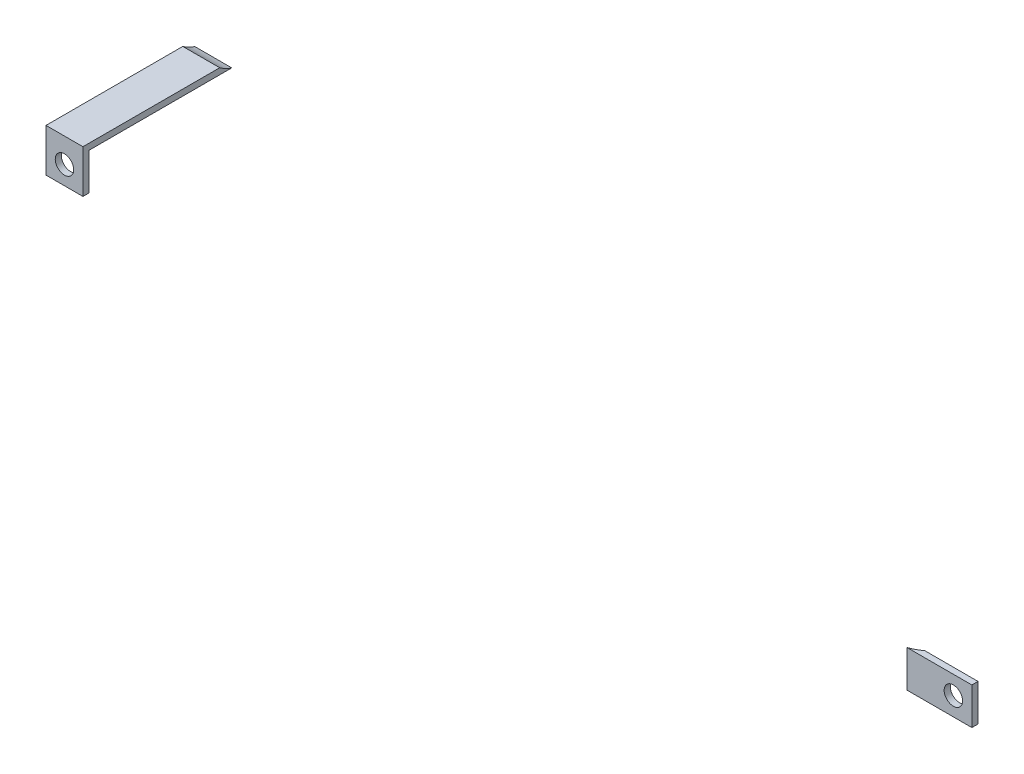
ISO-10303-21;
HEADER;
FILE_DESCRIPTION(('STEP AP214'),'2;1');
FILE_NAME('part.step','',(''),(''),'','','');
FILE_SCHEMA(('AUTOMOTIVE_DESIGN { 1 0 10303 214 1 1 1 1 }'));
ENDSEC;
DATA;
#1=APPLICATION_CONTEXT('core data for automotive mechanical design processes');
#2=APPLICATION_PROTOCOL_DEFINITION('international standard','automotive_design',2000,#1);
#3=PRODUCT_CONTEXT('',#1,'mechanical');
#4=PRODUCT('Part','Part','',(#3));
#5=PRODUCT_RELATED_PRODUCT_CATEGORY('part','',(#4));
#6=PRODUCT_DEFINITION_FORMATION('','',#4);
#7=PRODUCT_DEFINITION_CONTEXT('part definition',#1,'design');
#8=PRODUCT_DEFINITION('design','',#6,#7);
#9=PRODUCT_DEFINITION_SHAPE('','',#8);
#10=(LENGTH_UNIT() NAMED_UNIT(*) SI_UNIT(.MILLI.,.METRE.));
#11=(NAMED_UNIT(*) PLANE_ANGLE_UNIT() SI_UNIT($,.RADIAN.));
#12=(NAMED_UNIT(*) SI_UNIT($,.STERADIAN.) SOLID_ANGLE_UNIT());
#13=UNCERTAINTY_MEASURE_WITH_UNIT(LENGTH_MEASURE(1.E-05),#10,'distance_accuracy_value','');
#14=(GEOMETRIC_REPRESENTATION_CONTEXT(3) GLOBAL_UNCERTAINTY_ASSIGNED_CONTEXT((#13)) GLOBAL_UNIT_ASSIGNED_CONTEXT((#10,
#11,#12)) REPRESENTATION_CONTEXT('',''));
#15=CARTESIAN_POINT('',(0.,0.,0.));
#16=DIRECTION('',(0.,0.,1.));
#17=DIRECTION('',(1.,0.,0.));
#18=AXIS2_PLACEMENT_3D('',#15,#16,#17);
#19=CARTESIAN_POINT('',(-22.8519549129285,185.,100.));
#20=DIRECTION('',(-1.,0.,0.));
#21=DIRECTION('',(0.,0.,1.));
#22=AXIS2_PLACEMENT_3D('',#19,#20,#21);
#23=CYLINDRICAL_SURFACE('',#22,12.5);
#24=CARTESIAN_POINT('',(-34.8519549129285,185.,112.5));
#25=CARTESIAN_POINT('',(-34.8519549129285,160.,112.5));
#26=CARTESIAN_POINT('',(-34.8519549129285,160.,87.5));
#27=CARTESIAN_POINT('',(-34.8519549129285,185.,87.5));
#28=CARTESIAN_POINT('',(-34.8519549129285,210.,87.5));
#29=CARTESIAN_POINT('',(-34.8519549129285,210.,112.5));
#30=CARTESIAN_POINT('',(-34.8519549129285,185.,112.5));
#31=(BOUNDED_CURVE() B_SPLINE_CURVE(3,(#24,#25,#26,#27,#28,#29,#30),.UNSPECIFIED.,.T.,
.F.) B_SPLINE_CURVE_WITH_KNOTS((4,3,4),(0.,0.5,1.),
.UNSPECIFIED.) CURVE() GEOMETRIC_REPRESENTATION_ITEM() RATIONAL_B_SPLINE_CURVE((1.,
0.333333333333333,0.333333333333333,1.,0.333333333333333,0.333333333333333,1.)) REPRESENTATION_ITEM(''));
#32=CARTESIAN_POINT('',(-34.8519549129285,175.040321072079,107.553462494295));
#33=VERTEX_POINT('',#32);
#34=CARTESIAN_POINT('',(-34.8519549129285,173.040321072079,103.635392680446));
#35=VERTEX_POINT('',#34);
#36=EDGE_CURVE('E132',#33,#35,#31,.T.);
#37=ORIENTED_EDGE('',*,*,#36,.F.);
#38=DIRECTION('',(-1.,0.,0.));
#39=VECTOR('',#38,1.);
#40=CARTESIAN_POINT('',(-22.8519549129285,175.040321072079,107.553462494295));
#41=LINE('',#40,#39);
#42=CARTESIAN_POINT('',(-22.8519549129285,175.040321072079,107.553462494295));
#43=VERTEX_POINT('',#42);
#44=EDGE_CURVE('E12',#43,#33,#41,.T.);
#45=ORIENTED_EDGE('',*,*,#44,.F.);
#46=CARTESIAN_POINT('',(-22.8519549129285,185.,112.5));
#47=CARTESIAN_POINT('',(-22.8519549129285,160.,112.5));
#48=CARTESIAN_POINT('',(-22.8519549129285,160.,87.5));
#49=CARTESIAN_POINT('',(-22.8519549129285,185.,87.5));
#50=CARTESIAN_POINT('',(-22.8519549129285,210.,87.5));
#51=CARTESIAN_POINT('',(-22.8519549129285,210.,112.5));
#52=CARTESIAN_POINT('',(-22.8519549129285,185.,112.5));
#53=(BOUNDED_CURVE() B_SPLINE_CURVE(3,(#46,#47,#48,#49,#50,#51,#52),.UNSPECIFIED.,.T.,
.F.) B_SPLINE_CURVE_WITH_KNOTS((4,3,4),(0.,0.5,1.),
.UNSPECIFIED.) CURVE() GEOMETRIC_REPRESENTATION_ITEM() RATIONAL_B_SPLINE_CURVE((1.,
0.333333333333333,0.333333333333333,1.,0.333333333333333,0.333333333333333,1.)) REPRESENTATION_ITEM(''));
#54=CARTESIAN_POINT('',(-22.8519549129285,173.040321072079,103.635392680446));
#55=VERTEX_POINT('',#54);
#56=EDGE_CURVE('E152',#43,#55,#53,.T.);
#57=ORIENTED_EDGE('',*,*,#56,.T.);
#58=DIRECTION('',(-1.,0.,0.));
#59=VECTOR('',#58,1.);
#60=CARTESIAN_POINT('',(-22.8519549129285,173.040321072079,103.635392680446));
#61=LINE('',#60,#59);
#62=EDGE_CURVE('E50',#55,#35,#61,.T.);
#63=ORIENTED_EDGE('',*,*,#62,.T.);
#64=EDGE_LOOP('',(#37,#45,#57,#63));
#65=FACE_BOUND('',#64,.T.);
#66=ADVANCED_FACE('F47',(#65),#23,.F.);
#67=CARTESIAN_POINT('',(-22.8519549129285,175.040321072079,107.553462494295));
#68=DIRECTION('',(0.,1.,0.));
#69=DIRECTION('',(0.,0.,1.));
#70=AXIS2_PLACEMENT_3D('',#67,#68,#69);
#71=PLANE('',#70);
#72=DIRECTION('',(0.,0.,-1.));
#73=VECTOR('',#72,1.);
#74=CARTESIAN_POINT('',(-34.8519549129285,175.040321072079,107.553462494295));
#75=LINE('',#74,#73);
#76=CARTESIAN_POINT('',(-34.8519549129284,175.040321072076,152.));
#77=VERTEX_POINT('',#76);
#78=EDGE_CURVE('E150',#77,#33,#75,.T.);
#79=ORIENTED_EDGE('',*,*,#78,.F.);
#80=DIRECTION('',(-1.,0.,0.));
#81=VECTOR('',#80,1.);
#82=CARTESIAN_POINT('',(-22.8519549129284,175.040321072076,152.));
#83=LINE('',#82,#81);
#84=CARTESIAN_POINT('',(-22.8519549129284,175.040321072076,152.));
#85=VERTEX_POINT('',#84);
#86=EDGE_CURVE('E56',#85,#77,#83,.T.);
#87=ORIENTED_EDGE('',*,*,#86,.F.);
#88=DIRECTION('',(0.,0.,-1.));
#89=VECTOR('',#88,1.);
#90=CARTESIAN_POINT('',(-22.8519549129285,175.040321072079,107.553462494295));
#91=LINE('',#90,#89);
#92=EDGE_CURVE('E122',#85,#43,#91,.T.);
#93=ORIENTED_EDGE('',*,*,#92,.T.);
#94=ORIENTED_EDGE('',*,*,#44,.T.);
#95=EDGE_LOOP('',(#79,#87,#93,#94));
#96=FACE_BOUND('',#95,.T.);
#97=ADVANCED_FACE('F160',(#96),#71,.T.);
#98=CARTESIAN_POINT('',(-22.8519549129284,175.040321072076,152.));
#99=DIRECTION('',(0.,0.,1.));
#100=DIRECTION('',(1.,0.,0.));
#101=AXIS2_PLACEMENT_3D('',#98,#99,#100);
#102=PLANE('',#101);
#103=CARTESIAN_POINT('',(-28.8519549129285,167.040321072076,152.));
#104=DIRECTION('',(0.,0.,1.));
#105=DIRECTION('',(1.,0.,0.));
#106=AXIS2_PLACEMENT_3D('',#103,#104,#105);
#107=CIRCLE('',#106,2.99999999999999);
#108=CARTESIAN_POINT('',(-25.8519549129285,167.040321072076,152.));
#109=VERTEX_POINT('',#108);
#110=EDGE_CURVE('E138',#109,#109,#107,.T.);
#111=ORIENTED_EDGE('',*,*,#110,.F.);
#112=EDGE_LOOP('',(#111));
#113=FACE_BOUND('',#112,.T.);
#114=DIRECTION('',(0.,1.,0.));
#115=VECTOR('',#114,1.);
#116=CARTESIAN_POINT('',(-34.8519549129284,175.040321072076,152.));
#117=LINE('',#116,#115);
#118=CARTESIAN_POINT('',(-34.8519549129284,161.040321072076,152.));
#119=VERTEX_POINT('',#118);
#120=EDGE_CURVE('E109',#119,#77,#117,.T.);
#121=ORIENTED_EDGE('',*,*,#120,.F.);
#122=DIRECTION('',(-1.,0.,0.));
#123=VECTOR('',#122,1.);
#124=CARTESIAN_POINT('',(-22.8519549129284,161.040321072076,152.));
#125=LINE('',#124,#123);
#126=CARTESIAN_POINT('',(-22.8519549129284,161.040321072076,152.));
#127=VERTEX_POINT('',#126);
#128=EDGE_CURVE('E104',#127,#119,#125,.T.);
#129=ORIENTED_EDGE('',*,*,#128,.F.);
#130=DIRECTION('',(0.,1.,0.));
#131=VECTOR('',#130,1.);
#132=CARTESIAN_POINT('',(-22.8519549129284,175.040321072076,152.));
#133=LINE('',#132,#131);
#134=EDGE_CURVE('E107',#127,#85,#133,.T.);
#135=ORIENTED_EDGE('',*,*,#134,.T.);
#136=ORIENTED_EDGE('',*,*,#86,.T.);
#137=EDGE_LOOP('',(#121,#129,#135,#136));
#138=FACE_BOUND('',#137,.T.);
#139=ADVANCED_FACE('F106',(#113,#138),#102,.T.);
#140=CARTESIAN_POINT('',(-22.8519549129284,161.040321072076,152.));
#141=DIRECTION('',(0.,-1.,0.));
#142=DIRECTION('',(0.,0.,-1.));
#143=AXIS2_PLACEMENT_3D('',#140,#141,#142);
#144=PLANE('',#143);
#145=DIRECTION('',(0.,0.,1.));
#146=VECTOR('',#145,1.);
#147=CARTESIAN_POINT('',(-34.8519549129284,161.040321072076,152.));
#148=LINE('',#147,#146);
#149=CARTESIAN_POINT('',(-34.8519549129284,161.040321072076,150.));
#150=VERTEX_POINT('',#149);
#151=EDGE_CURVE('E147',#150,#119,#148,.T.);
#152=ORIENTED_EDGE('',*,*,#151,.F.);
#153=DIRECTION('',(-1.,0.,0.));
#154=VECTOR('',#153,1.);
#155=CARTESIAN_POINT('',(-22.8519549129284,161.040321072076,150.));
#156=LINE('',#155,#154);
#157=CARTESIAN_POINT('',(-22.8519549129284,161.040321072076,150.));
#158=VERTEX_POINT('',#157);
#159=EDGE_CURVE('E114',#158,#150,#156,.T.);
#160=ORIENTED_EDGE('',*,*,#159,.F.);
#161=DIRECTION('',(0.,0.,1.));
#162=VECTOR('',#161,1.);
#163=CARTESIAN_POINT('',(-22.8519549129284,161.040321072076,152.));
#164=LINE('',#163,#162);
#165=EDGE_CURVE('E120',#158,#127,#164,.T.);
#166=ORIENTED_EDGE('',*,*,#165,.T.);
#167=ORIENTED_EDGE('',*,*,#128,.T.);
#168=EDGE_LOOP('',(#152,#160,#166,#167));
#169=FACE_BOUND('',#168,.T.);
#170=ADVANCED_FACE('F124',(#169),#144,.T.);
#171=CARTESIAN_POINT('',(-22.8519549129284,161.040321072076,150.));
#172=DIRECTION('',(0.,0.,-1.));
#173=DIRECTION('',(0.,1.,0.));
#174=AXIS2_PLACEMENT_3D('',#171,#172,#173);
#175=PLANE('',#174);
#176=CARTESIAN_POINT('',(-28.8519549129285,167.040321072076,149.999999999999));
#177=DIRECTION('',(0.,0.,-1.));
#178=DIRECTION('',(0.,1.,0.));
#179=AXIS2_PLACEMENT_3D('',#176,#177,#178);
#180=CIRCLE('',#179,2.99999999999999);
#181=CARTESIAN_POINT('',(-28.8519549129285,170.040321072076,149.999999999999));
#182=VERTEX_POINT('',#181);
#183=EDGE_CURVE('E195',#182,#182,#180,.T.);
#184=ORIENTED_EDGE('',*,*,#183,.F.);
#185=EDGE_LOOP('',(#184));
#186=FACE_BOUND('',#185,.T.);
#187=DIRECTION('',(0.,-1.,0.));
#188=VECTOR('',#187,1.);
#189=CARTESIAN_POINT('',(-34.8519549129284,161.040321072076,150.));
#190=LINE('',#189,#188);
#191=CARTESIAN_POINT('',(-34.8519549129284,173.040321072076,150.));
#192=VERTEX_POINT('',#191);
#193=EDGE_CURVE('E144',#192,#150,#190,.T.);
#194=ORIENTED_EDGE('',*,*,#193,.F.);
#195=DIRECTION('',(-1.,0.,0.));
#196=VECTOR('',#195,1.);
#197=CARTESIAN_POINT('',(-22.8519549129284,173.040321072076,150.));
#198=LINE('',#197,#196);
#199=CARTESIAN_POINT('',(-22.8519549129284,173.040321072076,150.));
#200=VERTEX_POINT('',#199);
#201=EDGE_CURVE('E155',#200,#192,#198,.T.);
#202=ORIENTED_EDGE('',*,*,#201,.F.);
#203=DIRECTION('',(0.,-1.,0.));
#204=VECTOR('',#203,1.);
#205=CARTESIAN_POINT('',(-22.8519549129284,161.040321072076,150.));
#206=LINE('',#205,#204);
#207=EDGE_CURVE('E125',#200,#158,#206,.T.);
#208=ORIENTED_EDGE('',*,*,#207,.T.);
#209=ORIENTED_EDGE('',*,*,#159,.T.);
#210=EDGE_LOOP('',(#194,#202,#208,#209));
#211=FACE_BOUND('',#210,.T.);
#212=ADVANCED_FACE('F174',(#186,#211),#175,.T.);
#213=CARTESIAN_POINT('',(-22.8519549129284,173.040321072076,150.));
#214=DIRECTION('',(0.,-1.,0.));
#215=DIRECTION('',(0.,0.,-1.));
#216=AXIS2_PLACEMENT_3D('',#213,#214,#215);
#217=PLANE('',#216);
#218=DIRECTION('',(0.,0.,1.));
#219=VECTOR('',#218,1.);
#220=CARTESIAN_POINT('',(-34.8519549129284,173.040321072076,150.));
#221=LINE('',#220,#219);
#222=EDGE_CURVE('E137',#35,#192,#221,.T.);
#223=ORIENTED_EDGE('',*,*,#222,.F.);
#224=ORIENTED_EDGE('',*,*,#62,.F.);
#225=DIRECTION('',(0.,0.,1.));
#226=VECTOR('',#225,1.);
#227=CARTESIAN_POINT('',(-22.8519549129284,173.040321072076,150.));
#228=LINE('',#227,#226);
#229=EDGE_CURVE('E127',#55,#200,#228,.T.);
#230=ORIENTED_EDGE('',*,*,#229,.T.);
#231=ORIENTED_EDGE('',*,*,#201,.T.);
#232=EDGE_LOOP('',(#223,#224,#230,#231));
#233=FACE_BOUND('',#232,.T.);
#234=ADVANCED_FACE('F157',(#233),#217,.T.);
#235=CARTESIAN_POINT('',(-22.8519549129285,185.,87.5));
#236=DIRECTION('',(-1.,0.,0.));
#237=DIRECTION('',(0.,0.,1.));
#238=AXIS2_PLACEMENT_3D('',#235,#236,#237);
#239=PLANE('',#238);
#240=ORIENTED_EDGE('',*,*,#56,.F.);
#241=ORIENTED_EDGE('',*,*,#92,.F.);
#242=ORIENTED_EDGE('',*,*,#134,.F.);
#243=ORIENTED_EDGE('',*,*,#165,.F.);
#244=ORIENTED_EDGE('',*,*,#207,.F.);
#245=ORIENTED_EDGE('',*,*,#229,.F.);
#246=EDGE_LOOP('',(#240,#241,#242,#243,#244,#245));
#247=FACE_BOUND('',#246,.T.);
#248=ADVANCED_FACE('F118',(#247),#239,.F.);
#249=CARTESIAN_POINT('',(-34.8519549129285,185.,87.5));
#250=DIRECTION('',(-1.,0.,0.));
#251=DIRECTION('',(0.,0.,1.));
#252=AXIS2_PLACEMENT_3D('',#249,#250,#251);
#253=PLANE('',#252);
#254=ORIENTED_EDGE('',*,*,#36,.T.);
#255=ORIENTED_EDGE('',*,*,#222,.T.);
#256=ORIENTED_EDGE('',*,*,#193,.T.);
#257=ORIENTED_EDGE('',*,*,#151,.T.);
#258=ORIENTED_EDGE('',*,*,#120,.T.);
#259=ORIENTED_EDGE('',*,*,#78,.T.);
#260=EDGE_LOOP('',(#254,#255,#256,#257,#258,#259));
#261=FACE_BOUND('',#260,.T.);
#262=ADVANCED_FACE('F159',(#261),#253,.T.);
#263=CARTESIAN_POINT('',(-28.8519549129284,167.040321072076,161.999999999999));
#264=DIRECTION('',(0.,0.,-1.));
#265=DIRECTION('',(0.,1.,0.));
#266=AXIS2_PLACEMENT_3D('',#263,#264,#265);
#267=CYLINDRICAL_SURFACE('',#266,2.99999999999999);
#268=ORIENTED_EDGE('',*,*,#110,.T.);
#269=EDGE_LOOP('',(#268));
#270=FACE_BOUND('',#269,.T.);
#271=ORIENTED_EDGE('',*,*,#183,.T.);
#272=EDGE_LOOP('',(#271));
#273=FACE_BOUND('',#272,.T.);
#274=ADVANCED_FACE('F184',(#270,#273),#267,.F.);
#275=CLOSED_SHELL('',(#66,#97,#139,#170,#212,#234,#248,#262,#274));
#276=MANIFOLD_SOLID_BREP('B2',#275);
#277=CARTESIAN_POINT('',(200.00983325722,127.,99.1338889880595));
#278=DIRECTION('',(0.,-1.,0.));
#279=DIRECTION('',(0.,0.,-1.));
#280=AXIS2_PLACEMENT_3D('',#277,#278,#279);
#281=CYLINDRICAL_SURFACE('',#280,12.5);
#282=CARTESIAN_POINT('',(200.00983325722,115.,99.1338889880595));
#283=DIRECTION('',(0.,1.,0.));
#284=DIRECTION('',(0.,0.,-1.));
#285=AXIS2_PLACEMENT_3D('',#282,#283,#284);
#286=CIRCLE('',#285,12.5);
#287=CARTESIAN_POINT('',(203.939898072501,115.,111.));
#288=VERTEX_POINT('',#287);
#289=CARTESIAN_POINT('',(207.685108724594,115.,109.));
#290=VERTEX_POINT('',#289);
#291=EDGE_CURVE('E320',#288,#290,#286,.T.);
#292=ORIENTED_EDGE('',*,*,#291,.F.);
#293=DIRECTION('',(0.,-1.,0.));
#294=VECTOR('',#293,1.);
#295=CARTESIAN_POINT('',(203.939898072501,127.,111.));
#296=LINE('',#295,#294);
#297=CARTESIAN_POINT('',(203.939898072501,127.,111.));
#298=VERTEX_POINT('',#297);
#299=EDGE_CURVE('E45',#298,#288,#296,.T.);
#300=ORIENTED_EDGE('',*,*,#299,.F.);
#301=CARTESIAN_POINT('',(200.00983325722,127.,99.1338889880595));
#302=DIRECTION('',(0.,1.,0.));
#303=DIRECTION('',(0.,0.,-1.));
#304=AXIS2_PLACEMENT_3D('',#301,#302,#303);
#305=CIRCLE('',#304,12.5);
#306=CARTESIAN_POINT('',(207.685108724594,127.,109.));
#307=VERTEX_POINT('',#306);
#308=EDGE_CURVE('E313',#298,#307,#305,.T.);
#309=ORIENTED_EDGE('',*,*,#308,.T.);
#310=DIRECTION('',(0.,-1.,0.));
#311=VECTOR('',#310,1.);
#312=CARTESIAN_POINT('',(207.685108724594,127.,109.));
#313=LINE('',#312,#311);
#314=EDGE_CURVE('E258',#307,#290,#313,.T.);
#315=ORIENTED_EDGE('',*,*,#314,.T.);
#316=EDGE_LOOP('',(#292,#300,#309,#315));
#317=FACE_BOUND('',#316,.T.);
#318=ADVANCED_FACE('F255',(#317),#281,.F.);
#319=CARTESIAN_POINT('',(203.939898072501,127.,111.));
#320=DIRECTION('',(0.,0.,1.));
#321=DIRECTION('',(1.,0.,0.));
#322=AXIS2_PLACEMENT_3D('',#319,#320,#321);
#323=PLANE('',#322);
#324=CARTESIAN_POINT('',(219.,121.,111.));
#325=DIRECTION('',(0.,0.,1.));
#326=DIRECTION('',(1.,0.,0.));
#327=AXIS2_PLACEMENT_3D('',#324,#325,#326);
#328=CIRCLE('',#327,2.99999999999999);
#329=CARTESIAN_POINT('',(222.,121.,111.));
#330=VERTEX_POINT('',#329);
#331=EDGE_CURVE('E324',#330,#330,#328,.T.);
#332=ORIENTED_EDGE('',*,*,#331,.F.);
#333=EDGE_LOOP('',(#332));
#334=FACE_BOUND('',#333,.T.);
#335=DIRECTION('',(-1.,0.,0.));
#336=VECTOR('',#335,1.);
#337=CARTESIAN_POINT('',(203.939898072501,115.,111.));
#338=LINE('',#337,#336);
#339=CARTESIAN_POINT('',(225.,115.,111.));
#340=VERTEX_POINT('',#339);
#341=EDGE_CURVE('E315',#340,#288,#338,.T.);
#342=ORIENTED_EDGE('',*,*,#341,.F.);
#343=DIRECTION('',(0.,-1.,0.));
#344=VECTOR('',#343,1.);
#345=CARTESIAN_POINT('',(225.,127.,111.));
#346=LINE('',#345,#344);
#347=CARTESIAN_POINT('',(225.,127.,111.));
#348=VERTEX_POINT('',#347);
#349=EDGE_CURVE('E264',#348,#340,#346,.T.);
#350=ORIENTED_EDGE('',*,*,#349,.F.);
#351=DIRECTION('',(-1.,0.,0.));
#352=VECTOR('',#351,1.);
#353=CARTESIAN_POINT('',(203.939898072501,127.,111.));
#354=LINE('',#353,#352);
#355=EDGE_CURVE('E310',#348,#298,#354,.T.);
#356=ORIENTED_EDGE('',*,*,#355,.T.);
#357=ORIENTED_EDGE('',*,*,#299,.T.);
#358=EDGE_LOOP('',(#342,#350,#356,#357));
#359=FACE_BOUND('',#358,.T.);
#360=ADVANCED_FACE('F331',(#334,#359),#323,.T.);
#361=CARTESIAN_POINT('',(225.,127.,111.));
#362=DIRECTION('',(1.,0.,0.));
#363=DIRECTION('',(0.,0.,-1.));
#364=AXIS2_PLACEMENT_3D('',#361,#362,#363);
#365=PLANE('',#364);
#366=DIRECTION('',(0.,0.,1.));
#367=VECTOR('',#366,1.);
#368=CARTESIAN_POINT('',(225.,115.,111.));
#369=LINE('',#368,#367);
#370=CARTESIAN_POINT('',(225.,115.,109.));
#371=VERTEX_POINT('',#370);
#372=EDGE_CURVE('E305',#371,#340,#369,.T.);
#373=ORIENTED_EDGE('',*,*,#372,.F.);
#374=DIRECTION('',(0.,-1.,0.));
#375=VECTOR('',#374,1.);
#376=CARTESIAN_POINT('',(225.,127.,109.));
#377=LINE('',#376,#375);
#378=CARTESIAN_POINT('',(225.,127.,109.));
#379=VERTEX_POINT('',#378);
#380=EDGE_CURVE('E300',#379,#371,#377,.T.);
#381=ORIENTED_EDGE('',*,*,#380,.F.);
#382=DIRECTION('',(0.,0.,1.));
#383=VECTOR('',#382,1.);
#384=CARTESIAN_POINT('',(225.,127.,111.));
#385=LINE('',#384,#383);
#386=EDGE_CURVE('E303',#379,#348,#385,.T.);
#387=ORIENTED_EDGE('',*,*,#386,.T.);
#388=ORIENTED_EDGE('',*,*,#349,.T.);
#389=EDGE_LOOP('',(#373,#381,#387,#388));
#390=FACE_BOUND('',#389,.T.);
#391=ADVANCED_FACE('F302',(#390),#365,.T.);
#392=CARTESIAN_POINT('',(225.,127.,109.));
#393=DIRECTION('',(0.,0.,-1.));
#394=DIRECTION('',(-1.,0.,0.));
#395=AXIS2_PLACEMENT_3D('',#392,#393,#394);
#396=PLANE('',#395);
#397=CARTESIAN_POINT('',(219.,121.,109.));
#398=DIRECTION('',(0.,0.,-1.));
#399=DIRECTION('',(-1.,0.,0.));
#400=AXIS2_PLACEMENT_3D('',#397,#398,#399);
#401=CIRCLE('',#400,2.99999999999999);
#402=CARTESIAN_POINT('',(216.,121.,109.));
#403=VERTEX_POINT('',#402);
#404=EDGE_CURVE('E350',#403,#403,#401,.T.);
#405=ORIENTED_EDGE('',*,*,#404,.F.);
#406=EDGE_LOOP('',(#405));
#407=FACE_BOUND('',#406,.T.);
#408=DIRECTION('',(1.,0.,0.));
#409=VECTOR('',#408,1.);
#410=CARTESIAN_POINT('',(225.,115.,109.));
#411=LINE('',#410,#409);
#412=EDGE_CURVE('E323',#290,#371,#411,.T.);
#413=ORIENTED_EDGE('',*,*,#412,.F.);
#414=ORIENTED_EDGE('',*,*,#314,.F.);
#415=DIRECTION('',(1.,0.,0.));
#416=VECTOR('',#415,1.);
#417=CARTESIAN_POINT('',(225.,127.,109.));
#418=LINE('',#417,#416);
#419=EDGE_CURVE('E309',#307,#379,#418,.T.);
#420=ORIENTED_EDGE('',*,*,#419,.T.);
#421=ORIENTED_EDGE('',*,*,#380,.T.);
#422=EDGE_LOOP('',(#413,#414,#420,#421));
#423=FACE_BOUND('',#422,.T.);
#424=ADVANCED_FACE('F312',(#407,#423),#396,.T.);
#425=CARTESIAN_POINT('',(200.00983325722,127.,99.1338889880595));
#426=DIRECTION('',(0.,-1.,0.));
#427=DIRECTION('',(0.,0.,-1.));
#428=AXIS2_PLACEMENT_3D('',#425,#426,#427);
#429=PLANE('',#428);
#430=ORIENTED_EDGE('',*,*,#308,.F.);
#431=ORIENTED_EDGE('',*,*,#355,.F.);
#432=ORIENTED_EDGE('',*,*,#386,.F.);
#433=ORIENTED_EDGE('',*,*,#419,.F.);
#434=EDGE_LOOP('',(#430,#431,#432,#433));
#435=FACE_BOUND('',#434,.T.);
#436=ADVANCED_FACE('F308',(#435),#429,.F.);
#437=CARTESIAN_POINT('',(200.00983325722,115.,99.1338889880595));
#438=DIRECTION('',(0.,-1.,0.));
#439=DIRECTION('',(0.,0.,-1.));
#440=AXIS2_PLACEMENT_3D('',#437,#438,#439);
#441=PLANE('',#440);
#442=ORIENTED_EDGE('',*,*,#291,.T.);
#443=ORIENTED_EDGE('',*,*,#412,.T.);
#444=ORIENTED_EDGE('',*,*,#372,.T.);
#445=ORIENTED_EDGE('',*,*,#341,.T.);
#446=EDGE_LOOP('',(#442,#443,#444,#445));
#447=FACE_BOUND('',#446,.T.);
#448=ADVANCED_FACE('F330',(#447),#441,.T.);
#449=CARTESIAN_POINT('',(219.,121.,124.));
#450=DIRECTION('',(0.,0.,-1.));
#451=DIRECTION('',(-1.,0.,0.));
#452=AXIS2_PLACEMENT_3D('',#449,#450,#451);
#453=CYLINDRICAL_SURFACE('',#452,2.99999999999999);
#454=ORIENTED_EDGE('',*,*,#331,.T.);
#455=EDGE_LOOP('',(#454));
#456=FACE_BOUND('',#455,.T.);
#457=ORIENTED_EDGE('',*,*,#404,.T.);
#458=EDGE_LOOP('',(#457));
#459=FACE_BOUND('',#458,.T.);
#460=ADVANCED_FACE('F355',(#456,#459),#453,.F.);
#461=CLOSED_SHELL('',(#318,#360,#391,#424,#436,#448,#460));
#462=MANIFOLD_SOLID_BREP('B6',#461);
#463=ADVANCED_BREP_SHAPE_REPRESENTATION('',(#18,#276,#462),#14);
#464=SHAPE_DEFINITION_REPRESENTATION(#9,#463);
ENDSEC;
END-ISO-10303-21;
